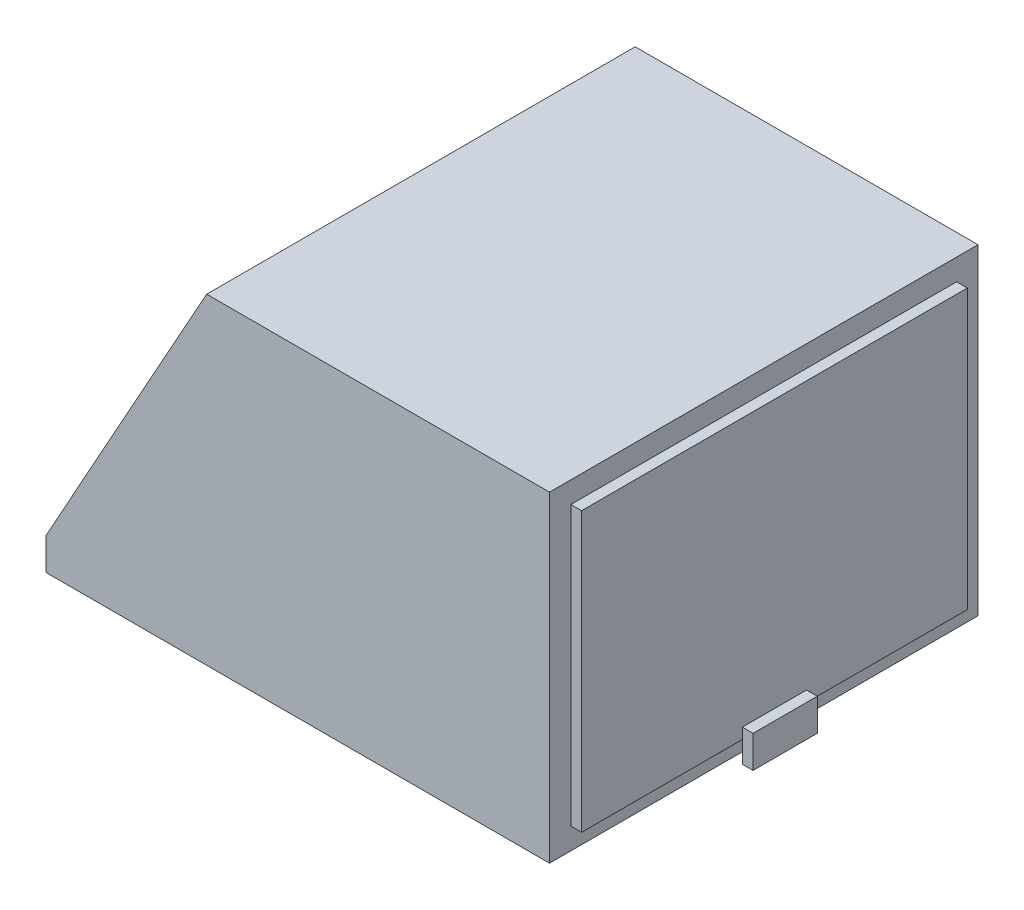
ISO-10303-21;
HEADER;
FILE_DESCRIPTION(('STEP AP214'),'2;1');
FILE_NAME('part.step','',(''),(''),'','','');
FILE_SCHEMA(('AUTOMOTIVE_DESIGN { 1 0 10303 214 1 1 1 1 }'));
ENDSEC;
DATA;
#1=APPLICATION_CONTEXT('core data for automotive mechanical design processes');
#2=APPLICATION_PROTOCOL_DEFINITION('international standard','automotive_design',2000,#1);
#3=PRODUCT_CONTEXT('',#1,'mechanical');
#4=PRODUCT('Part','Part','',(#3));
#5=PRODUCT_RELATED_PRODUCT_CATEGORY('part','',(#4));
#6=PRODUCT_DEFINITION_FORMATION('','',#4);
#7=PRODUCT_DEFINITION_CONTEXT('part definition',#1,'design');
#8=PRODUCT_DEFINITION('design','',#6,#7);
#9=PRODUCT_DEFINITION_SHAPE('','',#8);
#10=(LENGTH_UNIT() NAMED_UNIT(*) SI_UNIT(.MILLI.,.METRE.));
#11=(NAMED_UNIT(*) PLANE_ANGLE_UNIT() SI_UNIT($,.RADIAN.));
#12=(NAMED_UNIT(*) SI_UNIT($,.STERADIAN.) SOLID_ANGLE_UNIT());
#13=UNCERTAINTY_MEASURE_WITH_UNIT(LENGTH_MEASURE(1.E-05),#10,'distance_accuracy_value','');
#14=(GEOMETRIC_REPRESENTATION_CONTEXT(3) GLOBAL_UNCERTAINTY_ASSIGNED_CONTEXT((#13)) GLOBAL_UNIT_ASSIGNED_CONTEXT((#10,
#11,#12)) REPRESENTATION_CONTEXT('',''));
#15=CARTESIAN_POINT('',(0.,0.,0.));
#16=DIRECTION('',(0.,0.,1.));
#17=DIRECTION('',(1.,0.,0.));
#18=AXIS2_PLACEMENT_3D('',#15,#16,#17);
#19=CARTESIAN_POINT('',(12.2542372881356,15.5932203389831,0.));
#20=DIRECTION('',(-1.,0.,0.));
#21=DIRECTION('',(0.,-1.,0.));
#22=AXIS2_PLACEMENT_3D('',#19,#20,#21);
#23=PLANE('',#22);
#24=DIRECTION('',(0.,-1.,0.));
#25=VECTOR('',#24,1.);
#26=CARTESIAN_POINT('',(12.2542372881356,15.5932203389831,40.));
#27=LINE('',#26,#25);
#28=CARTESIAN_POINT('',(12.2542372881356,15.5932203389831,40.));
#29=VERTEX_POINT('',#28);
#30=CARTESIAN_POINT('',(12.2542372881356,-14.4067796610169,40.));
#31=VERTEX_POINT('',#30);
#32=EDGE_CURVE('E248',#29,#31,#27,.T.);
#33=ORIENTED_EDGE('',*,*,#32,.T.);
#34=DIRECTION('',(0.,0.,1.));
#35=VECTOR('',#34,1.);
#36=CARTESIAN_POINT('',(12.2542372881356,-14.4067796610169,0.));
#37=LINE('',#36,#35);
#38=CARTESIAN_POINT('',(12.2542372881356,-14.4067796610169,0.));
#39=VERTEX_POINT('',#38);
#40=EDGE_CURVE('E256',#39,#31,#37,.T.);
#41=ORIENTED_EDGE('',*,*,#40,.F.);
#42=DIRECTION('',(0.,-1.,0.));
#43=VECTOR('',#42,1.);
#44=CARTESIAN_POINT('',(12.2542372881356,15.5932203389831,0.));
#45=LINE('',#44,#43);
#46=CARTESIAN_POINT('',(12.2542372881356,15.5932203389831,0.));
#47=VERTEX_POINT('',#46);
#48=EDGE_CURVE('E249',#47,#39,#45,.T.);
#49=ORIENTED_EDGE('',*,*,#48,.F.);
#50=DIRECTION('',(0.,0.,1.));
#51=VECTOR('',#50,1.);
#52=CARTESIAN_POINT('',(12.2542372881356,15.5932203389831,0.));
#53=LINE('',#52,#51);
#54=EDGE_CURVE('E253',#47,#29,#53,.T.);
#55=ORIENTED_EDGE('',*,*,#54,.T.);
#56=EDGE_LOOP('',(#33,#41,#49,#55));
#57=FACE_BOUND('',#56,.T.);
#58=DIRECTION('',(0.,-1.,0.));
#59=VECTOR('',#58,1.);
#60=CARTESIAN_POINT('',(12.2542372881356,13.5932203389831,38.));
#61=LINE('',#60,#59);
#62=CARTESIAN_POINT('',(12.2542372881356,13.5932203389831,38.));
#63=VERTEX_POINT('',#62);
#64=CARTESIAN_POINT('',(12.2542372881356,-12.4067796610169,38.));
#65=VERTEX_POINT('',#64);
#66=EDGE_CURVE('E195',#63,#65,#61,.T.);
#67=ORIENTED_EDGE('',*,*,#66,.F.);
#68=DIRECTION('',(0.,0.,1.));
#69=VECTOR('',#68,1.);
#70=CARTESIAN_POINT('',(12.2542372881356,13.5932203389831,38.));
#71=LINE('',#70,#69);
#72=CARTESIAN_POINT('',(12.2542372881356,13.5932203389831,1.99999999999999));
#73=VERTEX_POINT('',#72);
#74=EDGE_CURVE('E211',#73,#63,#71,.T.);
#75=ORIENTED_EDGE('',*,*,#74,.F.);
#76=DIRECTION('',(0.,1.,0.));
#77=VECTOR('',#76,1.);
#78=CARTESIAN_POINT('',(12.2542372881356,13.5932203389831,1.99999999999999));
#79=LINE('',#78,#77);
#80=CARTESIAN_POINT('',(12.2542372881356,-12.4067796610169,1.99999999999999));
#81=VERTEX_POINT('',#80);
#82=EDGE_CURVE('E226',#81,#73,#79,.T.);
#83=ORIENTED_EDGE('',*,*,#82,.F.);
#84=DIRECTION('',(0.,0.,-1.));
#85=VECTOR('',#84,1.);
#86=CARTESIAN_POINT('',(12.2542372881356,-12.4067796610169,38.));
#87=LINE('',#86,#85);
#88=EDGE_CURVE('E200',#65,#81,#87,.T.);
#89=ORIENTED_EDGE('',*,*,#88,.F.);
#90=EDGE_LOOP('',(#67,#75,#83,#89));
#91=FACE_BOUND('',#90,.T.);
#92=ADVANCED_FACE('F41',(#57,#91),#23,.F.);
#93=CARTESIAN_POINT('',(-34.7457627118644,15.5932203389831,40.));
#94=DIRECTION('',(1.,0.,0.));
#95=DIRECTION('',(0.,1.,0.));
#96=AXIS2_PLACEMENT_3D('',#93,#94,#95);
#97=PLANE('',#96);
#98=DIRECTION('',(0.,-1.,0.));
#99=VECTOR('',#98,1.);
#100=CARTESIAN_POINT('',(-34.7457627118644,15.5932203389831,40.));
#101=LINE('',#100,#99);
#102=CARTESIAN_POINT('',(-34.7457627118644,-11.4067796610169,40.));
#103=VERTEX_POINT('',#102);
#104=CARTESIAN_POINT('',(-34.7457627118644,-14.4067796610169,40.));
#105=VERTEX_POINT('',#104);
#106=EDGE_CURVE('E322',#103,#105,#101,.T.);
#107=ORIENTED_EDGE('',*,*,#106,.F.);
#108=DIRECTION('',(0.,0.,1.));
#109=VECTOR('',#108,1.);
#110=CARTESIAN_POINT('',(-34.7457627118644,-11.4067796610169,0.));
#111=LINE('',#110,#109);
#112=CARTESIAN_POINT('',(-34.7457627118644,-11.4067796610169,0.));
#113=VERTEX_POINT('',#112);
#114=EDGE_CURVE('E311',#113,#103,#111,.T.);
#115=ORIENTED_EDGE('',*,*,#114,.F.);
#116=DIRECTION('',(0.,-1.,0.));
#117=VECTOR('',#116,1.);
#118=CARTESIAN_POINT('',(-34.7457627118644,15.5932203389831,0.));
#119=LINE('',#118,#117);
#120=CARTESIAN_POINT('',(-34.7457627118644,-14.4067796610169,0.));
#121=VERTEX_POINT('',#120);
#122=EDGE_CURVE('E319',#113,#121,#119,.T.);
#123=ORIENTED_EDGE('',*,*,#122,.T.);
#124=DIRECTION('',(0.,0.,-1.));
#125=VECTOR('',#124,1.);
#126=CARTESIAN_POINT('',(-34.7457627118644,-14.4067796610169,40.));
#127=LINE('',#126,#125);
#128=EDGE_CURVE('E45',#105,#121,#127,.T.);
#129=ORIENTED_EDGE('',*,*,#128,.F.);
#130=EDGE_LOOP('',(#107,#115,#123,#129));
#131=FACE_BOUND('',#130,.T.);
#132=ADVANCED_FACE('F43',(#131),#97,.F.);
#133=CARTESIAN_POINT('',(-34.7457627118644,-14.4067796610169,40.));
#134=DIRECTION('',(0.,1.,0.));
#135=DIRECTION('',(0.,0.,1.));
#136=AXIS2_PLACEMENT_3D('',#133,#134,#135);
#137=PLANE('',#136);
#138=DIRECTION('',(1.,0.,0.));
#139=VECTOR('',#138,1.);
#140=CARTESIAN_POINT('',(-34.7457627118644,-14.4067796610169,0.));
#141=LINE('',#140,#139);
#142=EDGE_CURVE('E335',#121,#39,#141,.T.);
#143=ORIENTED_EDGE('',*,*,#142,.T.);
#144=ORIENTED_EDGE('',*,*,#40,.T.);
#145=DIRECTION('',(1.,0.,0.));
#146=VECTOR('',#145,1.);
#147=CARTESIAN_POINT('',(-34.7457627118644,-14.4067796610169,40.));
#148=LINE('',#147,#146);
#149=EDGE_CURVE('E325',#105,#31,#148,.T.);
#150=ORIENTED_EDGE('',*,*,#149,.F.);
#151=ORIENTED_EDGE('',*,*,#128,.T.);
#152=EDGE_LOOP('',(#143,#144,#150,#151));
#153=FACE_BOUND('',#152,.T.);
#154=ADVANCED_FACE('F364',(#153),#137,.F.);
#155=CARTESIAN_POINT('',(-34.7457627118644,15.5932203389831,40.));
#156=DIRECTION('',(0.,-1.,0.));
#157=DIRECTION('',(0.,0.,-1.));
#158=AXIS2_PLACEMENT_3D('',#155,#156,#157);
#159=PLANE('',#158);
#160=DIRECTION('',(-1.,0.,0.));
#161=VECTOR('',#160,1.);
#162=CARTESIAN_POINT('',(-34.7457627118644,15.5932203389831,40.));
#163=LINE('',#162,#161);
#164=CARTESIAN_POINT('',(-19.7457627118644,15.5932203389831,40.));
#165=VERTEX_POINT('',#164);
#166=EDGE_CURVE('E330',#29,#165,#163,.T.);
#167=ORIENTED_EDGE('',*,*,#166,.F.);
#168=ORIENTED_EDGE('',*,*,#54,.F.);
#169=DIRECTION('',(-1.,0.,0.));
#170=VECTOR('',#169,1.);
#171=CARTESIAN_POINT('',(-34.7457627118644,15.5932203389831,0.));
#172=LINE('',#171,#170);
#173=CARTESIAN_POINT('',(-19.7457627118644,15.593220338983,0.));
#174=VERTEX_POINT('',#173);
#175=EDGE_CURVE('E326',#47,#174,#172,.T.);
#176=ORIENTED_EDGE('',*,*,#175,.T.);
#177=DIRECTION('',(0.,0.,1.));
#178=VECTOR('',#177,1.);
#179=CARTESIAN_POINT('',(-19.7457627118644,15.5932203389831,0.));
#180=LINE('',#179,#178);
#181=EDGE_CURVE('E315',#174,#165,#180,.T.);
#182=ORIENTED_EDGE('',*,*,#181,.T.);
#183=EDGE_LOOP('',(#167,#168,#176,#182));
#184=FACE_BOUND('',#183,.T.);
#185=ADVANCED_FACE('F344',(#184),#159,.F.);
#186=CARTESIAN_POINT('',(0.,0.,40.));
#187=DIRECTION('',(0.,0.,1.));
#188=DIRECTION('',(1.,0.,0.));
#189=AXIS2_PLACEMENT_3D('',#186,#187,#188);
#190=PLANE('',#189);
#191=ORIENTED_EDGE('',*,*,#32,.F.);
#192=ORIENTED_EDGE('',*,*,#166,.T.);
#193=DIRECTION('',(0.485642931178632,0.874157276121538,0.));
#194=VECTOR('',#193,1.);
#195=CARTESIAN_POINT('',(-34.7457627118644,-11.4067796610169,40.));
#196=LINE('',#195,#194);
#197=EDGE_CURVE('E297',#103,#165,#196,.T.);
#198=ORIENTED_EDGE('',*,*,#197,.F.);
#199=ORIENTED_EDGE('',*,*,#106,.T.);
#200=ORIENTED_EDGE('',*,*,#149,.T.);
#201=EDGE_LOOP('',(#191,#192,#198,#199,#200));
#202=FACE_BOUND('',#201,.T.);
#203=ADVANCED_FACE('F359',(#202),#190,.T.);
#204=CARTESIAN_POINT('',(0.,0.,0.));
#205=DIRECTION('',(0.,0.,1.));
#206=DIRECTION('',(1.,0.,0.));
#207=AXIS2_PLACEMENT_3D('',#204,#205,#206);
#208=PLANE('',#207);
#209=ORIENTED_EDGE('',*,*,#175,.F.);
#210=ORIENTED_EDGE('',*,*,#48,.T.);
#211=ORIENTED_EDGE('',*,*,#142,.F.);
#212=ORIENTED_EDGE('',*,*,#122,.F.);
#213=DIRECTION('',(0.485642931178632,0.874157276121538,0.));
#214=VECTOR('',#213,1.);
#215=CARTESIAN_POINT('',(-34.7457627118644,-11.4067796610169,0.));
#216=LINE('',#215,#214);
#217=EDGE_CURVE('E307',#113,#174,#216,.T.);
#218=ORIENTED_EDGE('',*,*,#217,.T.);
#219=EDGE_LOOP('',(#209,#210,#211,#212,#218));
#220=FACE_BOUND('',#219,.T.);
#221=ADVANCED_FACE('F351',(#220),#208,.F.);
#222=CARTESIAN_POINT('',(-34.7457627118644,-11.4067796610169,0.));
#223=DIRECTION('',(0.874157276121538,-0.485642931178632,0.));
#224=DIRECTION('',(0.485642931178632,0.874157276121538,0.));
#225=AXIS2_PLACEMENT_3D('',#222,#223,#224);
#226=PLANE('',#225);
#227=DIRECTION('',(0.,0.,1.));
#228=VECTOR('',#227,1.);
#229=CARTESIAN_POINT('',(-34.0172983150965,-10.0955437468346,1.));
#230=LINE('',#229,#228);
#231=CARTESIAN_POINT('',(-34.0172983150965,-10.0955437468346,1.));
#232=VERTEX_POINT('',#231);
#233=CARTESIAN_POINT('',(-34.0172983150965,-10.0955437468346,39.));
#234=VERTEX_POINT('',#233);
#235=EDGE_CURVE('E283',#232,#234,#230,.T.);
#236=ORIENTED_EDGE('',*,*,#235,.F.);
#237=DIRECTION('',(-0.485642931178632,-0.874157276121538,0.));
#238=VECTOR('',#237,1.);
#239=CARTESIAN_POINT('',(-20.4742271086324,14.2819844248007,1.));
#240=LINE('',#239,#238);
#241=CARTESIAN_POINT('',(-20.4742271086324,14.2819844248007,1.));
#242=VERTEX_POINT('',#241);
#243=EDGE_CURVE('E260',#242,#232,#240,.T.);
#244=ORIENTED_EDGE('',*,*,#243,.F.);
#245=DIRECTION('',(0.,0.,-1.));
#246=VECTOR('',#245,1.);
#247=CARTESIAN_POINT('',(-20.4742271086324,14.2819844248007,1.));
#248=LINE('',#247,#246);
#249=CARTESIAN_POINT('',(-20.4742271086324,14.2819844248007,39.));
#250=VERTEX_POINT('',#249);
#251=EDGE_CURVE('E268',#250,#242,#248,.T.);
#252=ORIENTED_EDGE('',*,*,#251,.F.);
#253=DIRECTION('',(0.485642931178632,0.874157276121538,0.));
#254=VECTOR('',#253,1.);
#255=CARTESIAN_POINT('',(-20.4742271086324,14.2819844248007,39.));
#256=LINE('',#255,#254);
#257=EDGE_CURVE('E287',#234,#250,#256,.T.);
#258=ORIENTED_EDGE('',*,*,#257,.F.);
#259=EDGE_LOOP('',(#236,#244,#252,#258));
#260=FACE_BOUND('',#259,.T.);
#261=ORIENTED_EDGE('',*,*,#197,.T.);
#262=ORIENTED_EDGE('',*,*,#181,.F.);
#263=ORIENTED_EDGE('',*,*,#217,.F.);
#264=ORIENTED_EDGE('',*,*,#114,.T.);
#265=EDGE_LOOP('',(#261,#262,#263,#264));
#266=FACE_BOUND('',#265,.T.);
#267=ADVANCED_FACE('F347',(#260,#266),#226,.F.);
#268=CARTESIAN_POINT('',(-19.6000698325108,13.7963414936221,1.));
#269=DIRECTION('',(0.,0.,-1.));
#270=DIRECTION('',(0.,1.,0.));
#271=AXIS2_PLACEMENT_3D('',#268,#269,#270);
#272=PLANE('',#271);
#273=ORIENTED_EDGE('',*,*,#243,.T.);
#274=DIRECTION('',(-0.874157276121538,0.485642931178632,0.));
#275=VECTOR('',#274,1.);
#276=CARTESIAN_POINT('',(-33.1431410389749,-10.5811866780133,1.));
#277=LINE('',#276,#275);
#278=CARTESIAN_POINT('',(-33.1431410389749,-10.5811866780133,1.));
#279=VERTEX_POINT('',#278);
#280=EDGE_CURVE('E280',#279,#232,#277,.T.);
#281=ORIENTED_EDGE('',*,*,#280,.F.);
#282=DIRECTION('',(-0.485642931178632,-0.874157276121538,0.));
#283=VECTOR('',#282,1.);
#284=CARTESIAN_POINT('',(-19.6000698325108,13.7963414936221,1.));
#285=LINE('',#284,#283);
#286=CARTESIAN_POINT('',(-19.6000698325108,13.7963414936221,1.));
#287=VERTEX_POINT('',#286);
#288=EDGE_CURVE('E263',#287,#279,#285,.T.);
#289=ORIENTED_EDGE('',*,*,#288,.F.);
#290=DIRECTION('',(-0.874157276121538,0.485642931178632,0.));
#291=VECTOR('',#290,1.);
#292=CARTESIAN_POINT('',(-19.6000698325108,13.7963414936221,1.));
#293=LINE('',#292,#291);
#294=EDGE_CURVE('E294',#287,#242,#293,.T.);
#295=ORIENTED_EDGE('',*,*,#294,.T.);
#296=EDGE_LOOP('',(#273,#281,#289,#295));
#297=FACE_BOUND('',#296,.T.);
#298=ADVANCED_FACE('F389',(#297),#272,.F.);
#299=CARTESIAN_POINT('',(-19.6000698325108,13.7963414936221,1.));
#300=DIRECTION('',(0.485642931178632,0.874157276121538,0.));
#301=DIRECTION('',(-0.874157276121538,0.485642931178632,0.));
#302=AXIS2_PLACEMENT_3D('',#299,#300,#301);
#303=PLANE('',#302);
#304=ORIENTED_EDGE('',*,*,#251,.T.);
#305=ORIENTED_EDGE('',*,*,#294,.F.);
#306=DIRECTION('',(0.,0.,-1.));
#307=VECTOR('',#306,1.);
#308=CARTESIAN_POINT('',(-19.6000698325108,13.7963414936221,1.));
#309=LINE('',#308,#307);
#310=CARTESIAN_POINT('',(-19.6000698325108,13.7963414936221,39.));
#311=VERTEX_POINT('',#310);
#312=EDGE_CURVE('E276',#311,#287,#309,.T.);
#313=ORIENTED_EDGE('',*,*,#312,.F.);
#314=DIRECTION('',(-0.874157276121538,0.485642931178632,0.));
#315=VECTOR('',#314,1.);
#316=CARTESIAN_POINT('',(-19.6000698325108,13.7963414936221,39.));
#317=LINE('',#316,#315);
#318=EDGE_CURVE('E298',#311,#250,#317,.T.);
#319=ORIENTED_EDGE('',*,*,#318,.T.);
#320=EDGE_LOOP('',(#304,#305,#313,#319));
#321=FACE_BOUND('',#320,.T.);
#322=ADVANCED_FACE('F385',(#321),#303,.F.);
#323=CARTESIAN_POINT('',(-19.6000698325108,13.7963414936221,39.));
#324=DIRECTION('',(0.,0.,1.));
#325=DIRECTION('',(1.,0.,0.));
#326=AXIS2_PLACEMENT_3D('',#323,#324,#325);
#327=PLANE('',#326);
#328=ORIENTED_EDGE('',*,*,#257,.T.);
#329=ORIENTED_EDGE('',*,*,#318,.F.);
#330=DIRECTION('',(0.485642931178632,0.874157276121538,0.));
#331=VECTOR('',#330,1.);
#332=CARTESIAN_POINT('',(-19.6000698325108,13.7963414936221,39.));
#333=LINE('',#332,#331);
#334=CARTESIAN_POINT('',(-33.1431410389749,-10.5811866780133,39.));
#335=VERTEX_POINT('',#334);
#336=EDGE_CURVE('E272',#335,#311,#333,.T.);
#337=ORIENTED_EDGE('',*,*,#336,.F.);
#338=DIRECTION('',(-0.874157276121538,0.485642931178632,0.));
#339=VECTOR('',#338,1.);
#340=CARTESIAN_POINT('',(-33.1431410389749,-10.5811866780133,39.));
#341=LINE('',#340,#339);
#342=EDGE_CURVE('E301',#335,#234,#341,.T.);
#343=ORIENTED_EDGE('',*,*,#342,.T.);
#344=EDGE_LOOP('',(#328,#329,#337,#343));
#345=FACE_BOUND('',#344,.T.);
#346=ADVANCED_FACE('F388',(#345),#327,.F.);
#347=CARTESIAN_POINT('',(-33.1431410389749,-10.5811866780133,1.));
#348=DIRECTION('',(-0.485642931178632,-0.874157276121538,0.));
#349=DIRECTION('',(0.874157276121538,-0.485642931178632,0.));
#350=AXIS2_PLACEMENT_3D('',#347,#348,#349);
#351=PLANE('',#350);
#352=ORIENTED_EDGE('',*,*,#235,.T.);
#353=ORIENTED_EDGE('',*,*,#342,.F.);
#354=DIRECTION('',(0.,0.,1.));
#355=VECTOR('',#354,1.);
#356=CARTESIAN_POINT('',(-33.1431410389749,-10.5811866780133,1.));
#357=LINE('',#356,#355);
#358=EDGE_CURVE('E267',#279,#335,#357,.T.);
#359=ORIENTED_EDGE('',*,*,#358,.F.);
#360=ORIENTED_EDGE('',*,*,#280,.T.);
#361=EDGE_LOOP('',(#352,#353,#359,#360));
#362=FACE_BOUND('',#361,.T.);
#363=ADVANCED_FACE('F383',(#362),#351,.F.);
#364=CARTESIAN_POINT('',(-20.8343492796828,11.5746384887126,0.));
#365=DIRECTION('',(-0.874157276121538,0.485642931178632,0.));
#366=DIRECTION('',(-0.485642931178632,-0.874157276121538,0.));
#367=AXIS2_PLACEMENT_3D('',#364,#365,#366);
#368=PLANE('',#367);
#369=ORIENTED_EDGE('',*,*,#288,.T.);
#370=ORIENTED_EDGE('',*,*,#358,.T.);
#371=ORIENTED_EDGE('',*,*,#336,.T.);
#372=ORIENTED_EDGE('',*,*,#312,.T.);
#373=EDGE_LOOP('',(#369,#370,#371,#372));
#374=FACE_BOUND('',#373,.T.);
#375=ADVANCED_FACE('F380',(#374),#368,.T.);
#376=CARTESIAN_POINT('',(13.2542372881356,13.5932203389831,38.));
#377=DIRECTION('',(0.,0.,-1.));
#378=DIRECTION('',(-1.,0.,0.));
#379=AXIS2_PLACEMENT_3D('',#376,#377,#378);
#380=PLANE('',#379);
#381=ORIENTED_EDGE('',*,*,#66,.T.);
#382=DIRECTION('',(-1.,0.,0.));
#383=VECTOR('',#382,1.);
#384=CARTESIAN_POINT('',(13.2542372881356,-12.4067796610169,38.));
#385=LINE('',#384,#383);
#386=CARTESIAN_POINT('',(13.2542372881356,-12.4067796610169,38.));
#387=VERTEX_POINT('',#386);
#388=EDGE_CURVE('E244',#387,#65,#385,.T.);
#389=ORIENTED_EDGE('',*,*,#388,.F.);
#390=DIRECTION('',(0.,-1.,0.));
#391=VECTOR('',#390,1.);
#392=CARTESIAN_POINT('',(13.2542372881356,13.5932203389831,38.));
#393=LINE('',#392,#391);
#394=CARTESIAN_POINT('',(13.2542372881356,13.5932203389831,38.));
#395=VERTEX_POINT('',#394);
#396=EDGE_CURVE('E206',#395,#387,#393,.T.);
#397=ORIENTED_EDGE('',*,*,#396,.F.);
#398=DIRECTION('',(-1.,0.,0.));
#399=VECTOR('',#398,1.);
#400=CARTESIAN_POINT('',(13.2542372881356,13.5932203389831,38.));
#401=LINE('',#400,#399);
#402=EDGE_CURVE('E221',#395,#63,#401,.T.);
#403=ORIENTED_EDGE('',*,*,#402,.T.);
#404=EDGE_LOOP('',(#381,#389,#397,#403));
#405=FACE_BOUND('',#404,.T.);
#406=ADVANCED_FACE('F378',(#405),#380,.F.);
#407=CARTESIAN_POINT('',(13.2542372881356,-12.4067796610169,38.));
#408=DIRECTION('',(0.,1.,0.));
#409=DIRECTION('',(-1.,0.,0.));
#410=AXIS2_PLACEMENT_3D('',#407,#408,#409);
#411=PLANE('',#410);
#412=ORIENTED_EDGE('',*,*,#88,.T.);
#413=DIRECTION('',(-1.,0.,0.));
#414=VECTOR('',#413,1.);
#415=CARTESIAN_POINT('',(13.2542372881356,-12.4067796610169,1.99999999999999));
#416=LINE('',#415,#414);
#417=CARTESIAN_POINT('',(13.2542372881356,-12.4067796610169,1.99999999999999));
#418=VERTEX_POINT('',#417);
#419=EDGE_CURVE('E240',#418,#81,#416,.T.);
#420=ORIENTED_EDGE('',*,*,#419,.F.);
#421=DIRECTION('',(0.,0.,-1.));
#422=VECTOR('',#421,1.);
#423=CARTESIAN_POINT('',(13.2542372881356,-12.4067796610169,38.));
#424=LINE('',#423,#422);
#425=CARTESIAN_POINT('',(13.2542372881356,-12.4067796610169,17.));
#426=VERTEX_POINT('',#425);
#427=EDGE_CURVE('E210',#426,#418,#424,.T.);
#428=ORIENTED_EDGE('',*,*,#427,.F.);
#429=CARTESIAN_POINT('',(13.2542372881356,-12.4067796610169,23.));
#430=VERTEX_POINT('',#429);
#431=EDGE_CURVE('E216',#430,#426,#424,.T.);
#432=ORIENTED_EDGE('',*,*,#431,.F.);
#433=EDGE_CURVE('E212',#387,#430,#424,.T.);
#434=ORIENTED_EDGE('',*,*,#433,.F.);
#435=ORIENTED_EDGE('',*,*,#388,.T.);
#436=EDGE_LOOP('',(#412,#420,#428,#432,#434,#435));
#437=FACE_BOUND('',#436,.T.);
#438=ADVANCED_FACE('F442',(#437),#411,.F.);
#439=CARTESIAN_POINT('',(13.2542372881356,13.5932203389831,1.99999999999999));
#440=DIRECTION('',(0.,0.,1.));
#441=DIRECTION('',(1.,0.,0.));
#442=AXIS2_PLACEMENT_3D('',#439,#440,#441);
#443=PLANE('',#442);
#444=ORIENTED_EDGE('',*,*,#82,.T.);
#445=DIRECTION('',(-1.,0.,0.));
#446=VECTOR('',#445,1.);
#447=CARTESIAN_POINT('',(13.2542372881356,13.5932203389831,1.99999999999999));
#448=LINE('',#447,#446);
#449=CARTESIAN_POINT('',(13.2542372881356,13.5932203389831,1.99999999999999));
#450=VERTEX_POINT('',#449);
#451=EDGE_CURVE('E236',#450,#73,#448,.T.);
#452=ORIENTED_EDGE('',*,*,#451,.F.);
#453=DIRECTION('',(0.,1.,0.));
#454=VECTOR('',#453,1.);
#455=CARTESIAN_POINT('',(13.2542372881356,13.5932203389831,1.99999999999999));
#456=LINE('',#455,#454);
#457=EDGE_CURVE('E215',#418,#450,#456,.T.);
#458=ORIENTED_EDGE('',*,*,#457,.F.);
#459=ORIENTED_EDGE('',*,*,#419,.T.);
#460=EDGE_LOOP('',(#444,#452,#458,#459));
#461=FACE_BOUND('',#460,.T.);
#462=ADVANCED_FACE('F450',(#461),#443,.F.);
#463=CARTESIAN_POINT('',(13.2542372881356,13.5932203389831,38.));
#464=DIRECTION('',(0.,-1.,0.));
#465=DIRECTION('',(1.,0.,0.));
#466=AXIS2_PLACEMENT_3D('',#463,#464,#465);
#467=PLANE('',#466);
#468=ORIENTED_EDGE('',*,*,#74,.T.);
#469=ORIENTED_EDGE('',*,*,#402,.F.);
#470=DIRECTION('',(0.,0.,1.));
#471=VECTOR('',#470,1.);
#472=CARTESIAN_POINT('',(13.2542372881356,13.5932203389831,38.));
#473=LINE('',#472,#471);
#474=EDGE_CURVE('E219',#450,#395,#473,.T.);
#475=ORIENTED_EDGE('',*,*,#474,.F.);
#476=ORIENTED_EDGE('',*,*,#451,.T.);
#477=EDGE_LOOP('',(#468,#469,#475,#476));
#478=FACE_BOUND('',#477,.T.);
#479=ADVANCED_FACE('F458',(#478),#467,.F.);
#480=CARTESIAN_POINT('',(13.2542372881356,0.,0.));
#481=DIRECTION('',(1.,0.,0.));
#482=DIRECTION('',(0.,1.,0.));
#483=AXIS2_PLACEMENT_3D('',#480,#481,#482);
#484=PLANE('',#483);
#485=DIRECTION('',(0.,-1.,0.));
#486=VECTOR('',#485,1.);
#487=CARTESIAN_POINT('',(13.2542372881356,-11.4067796610169,23.));
#488=LINE('',#487,#486);
#489=CARTESIAN_POINT('',(13.2542372881356,-11.4067796610169,23.));
#490=VERTEX_POINT('',#489);
#491=EDGE_CURVE('E59',#490,#430,#488,.T.);
#492=ORIENTED_EDGE('',*,*,#491,.F.);
#493=DIRECTION('',(0.,0.,1.));
#494=VECTOR('',#493,1.);
#495=CARTESIAN_POINT('',(13.2542372881356,-11.4067796610169,23.));
#496=LINE('',#495,#494);
#497=CARTESIAN_POINT('',(13.2542372881356,-11.4067796610169,17.));
#498=VERTEX_POINT('',#497);
#499=EDGE_CURVE('E188',#498,#490,#496,.T.);
#500=ORIENTED_EDGE('',*,*,#499,.F.);
#501=DIRECTION('',(0.,1.,0.));
#502=VECTOR('',#501,1.);
#503=CARTESIAN_POINT('',(13.2542372881356,-11.4067796610169,17.));
#504=LINE('',#503,#502);
#505=EDGE_CURVE('E11',#426,#498,#504,.T.);
#506=ORIENTED_EDGE('',*,*,#505,.F.);
#507=ORIENTED_EDGE('',*,*,#427,.T.);
#508=ORIENTED_EDGE('',*,*,#457,.T.);
#509=ORIENTED_EDGE('',*,*,#474,.T.);
#510=ORIENTED_EDGE('',*,*,#396,.T.);
#511=ORIENTED_EDGE('',*,*,#433,.T.);
#512=EDGE_LOOP('',(#492,#500,#506,#507,#508,#509,#510,#511));
#513=FACE_BOUND('',#512,.T.);
#514=ADVANCED_FACE('F465',(#513),#484,.T.);
#515=CARTESIAN_POINT('',(13.2542372881356,0.,0.));
#516=DIRECTION('',(1.,0.,0.));
#517=DIRECTION('',(0.,0.,-1.));
#518=AXIS2_PLACEMENT_3D('',#515,#516,#517);
#519=PLANE('',#518);
#520=CARTESIAN_POINT('',(13.2542372881356,-14.4067796610169,23.));
#521=VERTEX_POINT('',#520);
#522=EDGE_CURVE('E192',#430,#521,#488,.T.);
#523=ORIENTED_EDGE('',*,*,#522,.F.);
#524=ORIENTED_EDGE('',*,*,#431,.T.);
#525=CARTESIAN_POINT('',(13.2542372881356,-14.4067796610169,17.));
#526=VERTEX_POINT('',#525);
#527=EDGE_CURVE('E52',#526,#426,#504,.T.);
#528=ORIENTED_EDGE('',*,*,#527,.F.);
#529=DIRECTION('',(0.,0.,-1.));
#530=VECTOR('',#529,1.);
#531=CARTESIAN_POINT('',(13.2542372881356,-14.4067796610169,23.));
#532=LINE('',#531,#530);
#533=EDGE_CURVE('E591',#521,#526,#532,.T.);
#534=ORIENTED_EDGE('',*,*,#533,.F.);
#535=EDGE_LOOP('',(#523,#524,#528,#534));
#536=FACE_BOUND('',#535,.T.);
#537=ADVANCED_FACE('F472',(#536),#519,.F.);
#538=CARTESIAN_POINT('',(14.2542372881356,-11.4067796610169,23.));
#539=DIRECTION('',(0.,0.,-1.));
#540=DIRECTION('',(-1.,0.,0.));
#541=AXIS2_PLACEMENT_3D('',#538,#539,#540);
#542=PLANE('',#541);
#543=ORIENTED_EDGE('',*,*,#491,.T.);
#544=ORIENTED_EDGE('',*,*,#522,.T.);
#545=DIRECTION('',(-1.,0.,0.));
#546=VECTOR('',#545,1.);
#547=CARTESIAN_POINT('',(14.2542372881356,-14.4067796610169,23.));
#548=LINE('',#547,#546);
#549=CARTESIAN_POINT('',(14.2542372881356,-14.4067796610169,23.));
#550=VERTEX_POINT('',#549);
#551=EDGE_CURVE('E171',#550,#521,#548,.T.);
#552=ORIENTED_EDGE('',*,*,#551,.F.);
#553=DIRECTION('',(0.,-1.,0.));
#554=VECTOR('',#553,1.);
#555=CARTESIAN_POINT('',(14.2542372881356,-11.4067796610169,23.));
#556=LINE('',#555,#554);
#557=CARTESIAN_POINT('',(14.2542372881356,-11.4067796610169,23.));
#558=VERTEX_POINT('',#557);
#559=EDGE_CURVE('E178',#558,#550,#556,.T.);
#560=ORIENTED_EDGE('',*,*,#559,.F.);
#561=DIRECTION('',(-1.,0.,0.));
#562=VECTOR('',#561,1.);
#563=CARTESIAN_POINT('',(14.2542372881356,-11.4067796610169,23.));
#564=LINE('',#563,#562);
#565=EDGE_CURVE('E579',#558,#490,#564,.T.);
#566=ORIENTED_EDGE('',*,*,#565,.T.);
#567=EDGE_LOOP('',(#543,#544,#552,#560,#566));
#568=FACE_BOUND('',#567,.T.);
#569=ADVANCED_FACE('F190',(#568),#542,.F.);
#570=CARTESIAN_POINT('',(14.2542372881356,-14.4067796610169,23.));
#571=DIRECTION('',(0.,1.,0.));
#572=DIRECTION('',(-1.,0.,0.));
#573=AXIS2_PLACEMENT_3D('',#570,#571,#572);
#574=PLANE('',#573);
#575=ORIENTED_EDGE('',*,*,#533,.T.);
#576=DIRECTION('',(-1.,0.,0.));
#577=VECTOR('',#576,1.);
#578=CARTESIAN_POINT('',(14.2542372881356,-14.4067796610169,17.));
#579=LINE('',#578,#577);
#580=CARTESIAN_POINT('',(14.2542372881356,-14.4067796610169,17.));
#581=VERTEX_POINT('',#580);
#582=EDGE_CURVE('E173',#581,#526,#579,.T.);
#583=ORIENTED_EDGE('',*,*,#582,.F.);
#584=DIRECTION('',(0.,0.,-1.));
#585=VECTOR('',#584,1.);
#586=CARTESIAN_POINT('',(14.2542372881356,-14.4067796610169,23.));
#587=LINE('',#586,#585);
#588=EDGE_CURVE('E167',#550,#581,#587,.T.);
#589=ORIENTED_EDGE('',*,*,#588,.F.);
#590=ORIENTED_EDGE('',*,*,#551,.T.);
#591=EDGE_LOOP('',(#575,#583,#589,#590));
#592=FACE_BOUND('',#591,.T.);
#593=ADVANCED_FACE('F169',(#592),#574,.F.);
#594=CARTESIAN_POINT('',(14.2542372881356,-11.4067796610169,17.));
#595=DIRECTION('',(0.,0.,1.));
#596=DIRECTION('',(1.,0.,0.));
#597=AXIS2_PLACEMENT_3D('',#594,#595,#596);
#598=PLANE('',#597);
#599=ORIENTED_EDGE('',*,*,#527,.T.);
#600=ORIENTED_EDGE('',*,*,#505,.T.);
#601=DIRECTION('',(-1.,0.,0.));
#602=VECTOR('',#601,1.);
#603=CARTESIAN_POINT('',(14.2542372881356,-11.4067796610169,17.));
#604=LINE('',#603,#602);
#605=CARTESIAN_POINT('',(14.2542372881356,-11.4067796610169,17.));
#606=VERTEX_POINT('',#605);
#607=EDGE_CURVE('E202',#606,#498,#604,.T.);
#608=ORIENTED_EDGE('',*,*,#607,.F.);
#609=DIRECTION('',(0.,1.,0.));
#610=VECTOR('',#609,1.);
#611=CARTESIAN_POINT('',(14.2542372881356,-11.4067796610169,17.));
#612=LINE('',#611,#610);
#613=EDGE_CURVE('E177',#581,#606,#612,.T.);
#614=ORIENTED_EDGE('',*,*,#613,.F.);
#615=ORIENTED_EDGE('',*,*,#582,.T.);
#616=EDGE_LOOP('',(#599,#600,#608,#614,#615));
#617=FACE_BOUND('',#616,.T.);
#618=ADVANCED_FACE('F491',(#617),#598,.F.);
#619=CARTESIAN_POINT('',(14.2542372881356,-11.4067796610169,23.));
#620=DIRECTION('',(0.,-1.,0.));
#621=DIRECTION('',(1.,0.,0.));
#622=AXIS2_PLACEMENT_3D('',#619,#620,#621);
#623=PLANE('',#622);
#624=ORIENTED_EDGE('',*,*,#499,.T.);
#625=ORIENTED_EDGE('',*,*,#565,.F.);
#626=DIRECTION('',(0.,0.,1.));
#627=VECTOR('',#626,1.);
#628=CARTESIAN_POINT('',(14.2542372881356,-11.4067796610169,23.));
#629=LINE('',#628,#627);
#630=EDGE_CURVE('E183',#606,#558,#629,.T.);
#631=ORIENTED_EDGE('',*,*,#630,.F.);
#632=ORIENTED_EDGE('',*,*,#607,.T.);
#633=EDGE_LOOP('',(#624,#625,#631,#632));
#634=FACE_BOUND('',#633,.T.);
#635=ADVANCED_FACE('F498',(#634),#623,.F.);
#636=CARTESIAN_POINT('',(14.2542372881356,0.,0.));
#637=DIRECTION('',(1.,0.,0.));
#638=DIRECTION('',(0.,0.,-1.));
#639=AXIS2_PLACEMENT_3D('',#636,#637,#638);
#640=PLANE('',#639);
#641=ORIENTED_EDGE('',*,*,#559,.T.);
#642=ORIENTED_EDGE('',*,*,#588,.T.);
#643=ORIENTED_EDGE('',*,*,#613,.T.);
#644=ORIENTED_EDGE('',*,*,#630,.T.);
#645=EDGE_LOOP('',(#641,#642,#643,#644));
#646=FACE_BOUND('',#645,.T.);
#647=ADVANCED_FACE('F181',(#646),#640,.T.);
#648=CLOSED_SHELL('',(#92,#132,#154,#185,#203,#221,#267,#298,#322,#346,#363,#375,#406,#438,#462,
#479,#514,#537,#569,#593,#618,#635,#647));
#649=MANIFOLD_SOLID_BREP('B2',#648);
#650=ADVANCED_BREP_SHAPE_REPRESENTATION('',(#18,#649),#14);
#651=SHAPE_DEFINITION_REPRESENTATION(#9,#650);
ENDSEC;
END-ISO-10303-21;
